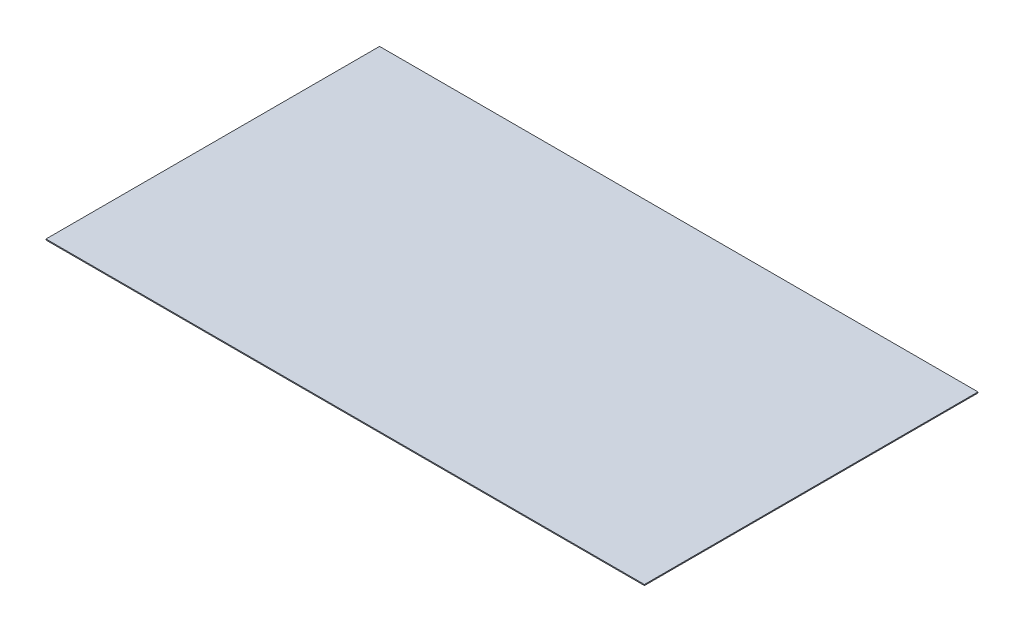
ISO-10303-21;
HEADER;
FILE_DESCRIPTION(('STEP AP214'),'2;1');
FILE_NAME('part.step','',(''),(''),'','','');
FILE_SCHEMA(('AUTOMOTIVE_DESIGN { 1 0 10303 214 1 1 1 1 }'));
ENDSEC;
DATA;
#1=APPLICATION_CONTEXT('core data for automotive mechanical design processes');
#2=APPLICATION_PROTOCOL_DEFINITION('international standard','automotive_design',2000,#1);
#3=PRODUCT_CONTEXT('',#1,'mechanical');
#4=PRODUCT('Part','Part','',(#3));
#5=PRODUCT_RELATED_PRODUCT_CATEGORY('part','',(#4));
#6=PRODUCT_DEFINITION_FORMATION('','',#4);
#7=PRODUCT_DEFINITION_CONTEXT('part definition',#1,'design');
#8=PRODUCT_DEFINITION('design','',#6,#7);
#9=PRODUCT_DEFINITION_SHAPE('','',#8);
#10=(LENGTH_UNIT() NAMED_UNIT(*) SI_UNIT(.MILLI.,.METRE.));
#11=(NAMED_UNIT(*) PLANE_ANGLE_UNIT() SI_UNIT($,.RADIAN.));
#12=(NAMED_UNIT(*) SI_UNIT($,.STERADIAN.) SOLID_ANGLE_UNIT());
#13=UNCERTAINTY_MEASURE_WITH_UNIT(LENGTH_MEASURE(1.E-05),#10,'distance_accuracy_value','');
#14=(GEOMETRIC_REPRESENTATION_CONTEXT(3) GLOBAL_UNCERTAINTY_ASSIGNED_CONTEXT((#13)) GLOBAL_UNIT_ASSIGNED_CONTEXT((#10,
#11,#12)) REPRESENTATION_CONTEXT('',''));
#15=CARTESIAN_POINT('',(0.,0.,0.));
#16=DIRECTION('',(0.,0.,1.));
#17=DIRECTION('',(1.,0.,0.));
#18=AXIS2_PLACEMENT_3D('',#15,#16,#17);
#19=CARTESIAN_POINT('',(0.,1.,0.));
#20=DIRECTION('',(1.,0.,0.));
#21=DIRECTION('',(0.,0.,-1.));
#22=AXIS2_PLACEMENT_3D('',#19,#20,#21);
#23=PLANE('',#22);
#24=DIRECTION('',(0.,0.,1.));
#25=VECTOR('',#24,1.);
#26=CARTESIAN_POINT('',(0.,0.,0.));
#27=LINE('',#26,#25);
#28=CARTESIAN_POINT('',(0.,0.,-340.));
#29=VERTEX_POINT('',#28);
#30=CARTESIAN_POINT('',(0.,0.,0.));
#31=VERTEX_POINT('',#30);
#32=EDGE_CURVE('E94',#29,#31,#27,.T.);
#33=ORIENTED_EDGE('',*,*,#32,.T.);
#34=DIRECTION('',(0.,-1.,0.));
#35=VECTOR('',#34,1.);
#36=CARTESIAN_POINT('',(0.,1.,0.));
#37=LINE('',#36,#35);
#38=CARTESIAN_POINT('',(0.,1.,0.));
#39=VERTEX_POINT('',#38);
#40=EDGE_CURVE('E11',#39,#31,#37,.T.);
#41=ORIENTED_EDGE('',*,*,#40,.F.);
#42=DIRECTION('',(0.,0.,1.));
#43=VECTOR('',#42,1.);
#44=CARTESIAN_POINT('',(0.,1.,0.));
#45=LINE('',#44,#43);
#46=CARTESIAN_POINT('',(0.,1.,-340.));
#47=VERTEX_POINT('',#46);
#48=EDGE_CURVE('E82',#47,#39,#45,.T.);
#49=ORIENTED_EDGE('',*,*,#48,.F.);
#50=DIRECTION('',(0.,-1.,0.));
#51=VECTOR('',#50,1.);
#52=CARTESIAN_POINT('',(0.,1.,-340.));
#53=LINE('',#52,#51);
#54=EDGE_CURVE('E90',#47,#29,#53,.T.);
#55=ORIENTED_EDGE('',*,*,#54,.T.);
#56=EDGE_LOOP('',(#33,#41,#49,#55));
#57=FACE_BOUND('',#56,.T.);
#58=ADVANCED_FACE('F31',(#57),#23,.F.);
#59=CARTESIAN_POINT('',(0.,1.,0.));
#60=DIRECTION('',(0.,0.,-1.));
#61=DIRECTION('',(-1.,0.,0.));
#62=AXIS2_PLACEMENT_3D('',#59,#60,#61);
#63=PLANE('',#62);
#64=DIRECTION('',(1.,0.,0.));
#65=VECTOR('',#64,1.);
#66=CARTESIAN_POINT('',(0.,0.,0.));
#67=LINE('',#66,#65);
#68=CARTESIAN_POINT('',(610.,0.,0.));
#69=VERTEX_POINT('',#68);
#70=EDGE_CURVE('E86',#31,#69,#67,.T.);
#71=ORIENTED_EDGE('',*,*,#70,.T.);
#72=DIRECTION('',(0.,-1.,0.));
#73=VECTOR('',#72,1.);
#74=CARTESIAN_POINT('',(610.,1.,0.));
#75=LINE('',#74,#73);
#76=CARTESIAN_POINT('',(610.,1.,0.));
#77=VERTEX_POINT('',#76);
#78=EDGE_CURVE('E39',#77,#69,#75,.T.);
#79=ORIENTED_EDGE('',*,*,#78,.F.);
#80=DIRECTION('',(1.,0.,0.));
#81=VECTOR('',#80,1.);
#82=CARTESIAN_POINT('',(0.,1.,0.));
#83=LINE('',#82,#81);
#84=EDGE_CURVE('E77',#39,#77,#83,.T.);
#85=ORIENTED_EDGE('',*,*,#84,.F.);
#86=ORIENTED_EDGE('',*,*,#40,.T.);
#87=EDGE_LOOP('',(#71,#79,#85,#86));
#88=FACE_BOUND('',#87,.T.);
#89=ADVANCED_FACE('F85',(#88),#63,.F.);
#90=CARTESIAN_POINT('',(610.,1.,0.));
#91=DIRECTION('',(-1.,0.,0.));
#92=DIRECTION('',(0.,0.,1.));
#93=AXIS2_PLACEMENT_3D('',#90,#91,#92);
#94=PLANE('',#93);
#95=DIRECTION('',(0.,0.,-1.));
#96=VECTOR('',#95,1.);
#97=CARTESIAN_POINT('',(610.,0.,0.));
#98=LINE('',#97,#96);
#99=CARTESIAN_POINT('',(610.,0.,-340.));
#100=VERTEX_POINT('',#99);
#101=EDGE_CURVE('E64',#69,#100,#98,.T.);
#102=ORIENTED_EDGE('',*,*,#101,.T.);
#103=DIRECTION('',(0.,-1.,0.));
#104=VECTOR('',#103,1.);
#105=CARTESIAN_POINT('',(610.,1.,-340.));
#106=LINE('',#105,#104);
#107=CARTESIAN_POINT('',(610.,1.,-340.));
#108=VERTEX_POINT('',#107);
#109=EDGE_CURVE('E87',#108,#100,#106,.T.);
#110=ORIENTED_EDGE('',*,*,#109,.F.);
#111=DIRECTION('',(0.,0.,-1.));
#112=VECTOR('',#111,1.);
#113=CARTESIAN_POINT('',(610.,1.,0.));
#114=LINE('',#113,#112);
#115=EDGE_CURVE('E80',#77,#108,#114,.T.);
#116=ORIENTED_EDGE('',*,*,#115,.F.);
#117=ORIENTED_EDGE('',*,*,#78,.T.);
#118=EDGE_LOOP('',(#102,#110,#116,#117));
#119=FACE_BOUND('',#118,.T.);
#120=ADVANCED_FACE('F88',(#119),#94,.F.);
#121=CARTESIAN_POINT('',(0.,1.,-340.));
#122=DIRECTION('',(0.,0.,1.));
#123=DIRECTION('',(1.,0.,0.));
#124=AXIS2_PLACEMENT_3D('',#121,#122,#123);
#125=PLANE('',#124);
#126=DIRECTION('',(-1.,0.,0.));
#127=VECTOR('',#126,1.);
#128=CARTESIAN_POINT('',(0.,0.,-340.));
#129=LINE('',#128,#127);
#130=EDGE_CURVE('E70',#100,#29,#129,.T.);
#131=ORIENTED_EDGE('',*,*,#130,.T.);
#132=ORIENTED_EDGE('',*,*,#54,.F.);
#133=DIRECTION('',(-1.,0.,0.));
#134=VECTOR('',#133,1.);
#135=CARTESIAN_POINT('',(0.,1.,-340.));
#136=LINE('',#135,#134);
#137=EDGE_CURVE('E47',#108,#47,#136,.T.);
#138=ORIENTED_EDGE('',*,*,#137,.F.);
#139=ORIENTED_EDGE('',*,*,#109,.T.);
#140=EDGE_LOOP('',(#131,#132,#138,#139));
#141=FACE_BOUND('',#140,.T.);
#142=ADVANCED_FACE('F101',(#141),#125,.F.);
#143=CARTESIAN_POINT('',(0.,1.,-340.));
#144=DIRECTION('',(0.,-1.,0.));
#145=DIRECTION('',(0.,0.,-1.));
#146=AXIS2_PLACEMENT_3D('',#143,#144,#145);
#147=PLANE('',#146);
#148=ORIENTED_EDGE('',*,*,#48,.T.);
#149=ORIENTED_EDGE('',*,*,#84,.T.);
#150=ORIENTED_EDGE('',*,*,#115,.T.);
#151=ORIENTED_EDGE('',*,*,#137,.T.);
#152=EDGE_LOOP('',(#148,#149,#150,#151));
#153=FACE_BOUND('',#152,.T.);
#154=ADVANCED_FACE('F78',(#153),#147,.F.);
#155=CARTESIAN_POINT('',(0.,0.,-340.));
#156=DIRECTION('',(0.,-1.,0.));
#157=DIRECTION('',(0.,0.,-1.));
#158=AXIS2_PLACEMENT_3D('',#155,#156,#157);
#159=PLANE('',#158);
#160=ORIENTED_EDGE('',*,*,#32,.F.);
#161=ORIENTED_EDGE('',*,*,#130,.F.);
#162=ORIENTED_EDGE('',*,*,#101,.F.);
#163=ORIENTED_EDGE('',*,*,#70,.F.);
#164=EDGE_LOOP('',(#160,#161,#162,#163));
#165=FACE_BOUND('',#164,.T.);
#166=ADVANCED_FACE('F104',(#165),#159,.T.);
#167=CLOSED_SHELL('',(#58,#89,#120,#142,#154,#166));
#168=MANIFOLD_SOLID_BREP('B2',#167);
#169=ADVANCED_BREP_SHAPE_REPRESENTATION('',(#18,#168),#14);
#170=SHAPE_DEFINITION_REPRESENTATION(#9,#169);
ENDSEC;
END-ISO-10303-21;
